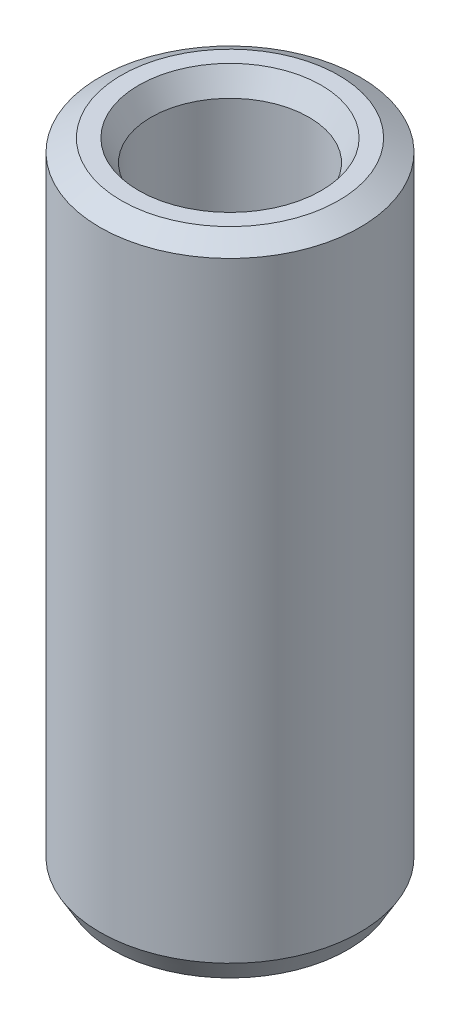
ISO-10303-21;
HEADER;
FILE_DESCRIPTION(('STEP AP214'),'2;1');
FILE_NAME('part.step','',(''),(''),'','','');
FILE_SCHEMA(('AUTOMOTIVE_DESIGN { 1 0 10303 214 1 1 1 1 }'));
ENDSEC;
DATA;
#1=APPLICATION_CONTEXT('core data for automotive mechanical design processes');
#2=APPLICATION_PROTOCOL_DEFINITION('international standard','automotive_design',2000,#1);
#3=PRODUCT_CONTEXT('',#1,'mechanical');
#4=PRODUCT('Part','Part','',(#3));
#5=PRODUCT_RELATED_PRODUCT_CATEGORY('part','',(#4));
#6=PRODUCT_DEFINITION_FORMATION('','',#4);
#7=PRODUCT_DEFINITION_CONTEXT('part definition',#1,'design');
#8=PRODUCT_DEFINITION('design','',#6,#7);
#9=PRODUCT_DEFINITION_SHAPE('','',#8);
#10=(LENGTH_UNIT() NAMED_UNIT(*) SI_UNIT(.MILLI.,.METRE.));
#11=(NAMED_UNIT(*) PLANE_ANGLE_UNIT() SI_UNIT($,.RADIAN.));
#12=(NAMED_UNIT(*) SI_UNIT($,.STERADIAN.) SOLID_ANGLE_UNIT());
#13=UNCERTAINTY_MEASURE_WITH_UNIT(LENGTH_MEASURE(1.E-05),#10,'distance_accuracy_value','');
#14=(GEOMETRIC_REPRESENTATION_CONTEXT(3) GLOBAL_UNCERTAINTY_ASSIGNED_CONTEXT((#13)) GLOBAL_UNIT_ASSIGNED_CONTEXT((#10,
#11,#12)) REPRESENTATION_CONTEXT('',''));
#15=CARTESIAN_POINT('',(0.,0.,0.));
#16=DIRECTION('',(0.,0.,1.));
#17=DIRECTION('',(1.,0.,0.));
#18=AXIS2_PLACEMENT_3D('',#15,#16,#17);
#19=CARTESIAN_POINT('',(0.,111.401906015621,0.));
#20=DIRECTION('',(0.,-1.,0.));
#21=DIRECTION('',(0.,0.,-1.));
#22=AXIS2_PLACEMENT_3D('',#19,#20,#21);
#23=CYLINDRICAL_SURFACE('',#22,22.5);
#24=CARTESIAN_POINT('',(0.,3.71535277580133,0.));
#25=DIRECTION('',(0.,1.,0.));
#26=DIRECTION('',(0.,0.,1.));
#27=AXIS2_PLACEMENT_3D('',#24,#25,#26);
#28=CIRCLE('',#27,22.5);
#29=CARTESIAN_POINT('',(0.,3.71535277580133,22.5));
#30=VERTEX_POINT('',#29);
#31=EDGE_CURVE('E10',#30,#30,#28,.T.);
#32=ORIENTED_EDGE('',*,*,#31,.T.);
#33=EDGE_LOOP('',(#32));
#34=FACE_BOUND('',#33,.T.);
#35=CARTESIAN_POINT('',(0.,109.256846090378,0.));
#36=DIRECTION('',(0.,1.,0.));
#37=DIRECTION('',(0.,0.,1.));
#38=AXIS2_PLACEMENT_3D('',#35,#36,#37);
#39=CIRCLE('',#38,22.5);
#40=CARTESIAN_POINT('',(0.,109.256846090378,22.5));
#41=VERTEX_POINT('',#40);
#42=EDGE_CURVE('E50',#41,#41,#39,.F.);
#43=ORIENTED_EDGE('',*,*,#42,.T.);
#44=EDGE_LOOP('',(#43));
#45=FACE_BOUND('',#44,.T.);
#46=ADVANCED_FACE('F39',(#34,#45),#23,.T.);
#47=CARTESIAN_POINT('',(0.,111.401906015621,0.));
#48=DIRECTION('',(0.,1.,0.));
#49=DIRECTION('',(0.,0.,1.));
#50=AXIS2_PLACEMENT_3D('',#47,#48,#49);
#51=PLANE('',#50);
#52=CARTESIAN_POINT('',(0.,111.401906015621,0.));
#53=DIRECTION('',(0.,1.,0.));
#54=DIRECTION('',(0.,0.,1.));
#55=AXIS2_PLACEMENT_3D('',#52,#53,#54);
#56=CIRCLE('',#55,15.7867235706911);
#57=CARTESIAN_POINT('',(0.,111.401906015621,15.7867235706911));
#58=VERTEX_POINT('',#57);
#59=EDGE_CURVE('E58',#58,#58,#56,.F.);
#60=ORIENTED_EDGE('',*,*,#59,.T.);
#61=EDGE_LOOP('',(#60));
#62=FACE_BOUND('',#61,.T.);
#63=CARTESIAN_POINT('',(0.,111.401906015621,0.));
#64=DIRECTION('',(0.,1.,0.));
#65=DIRECTION('',(0.,0.,1.));
#66=AXIS2_PLACEMENT_3D('',#63,#64,#65);
#67=CIRCLE('',#66,18.7846472241987);
#68=CARTESIAN_POINT('',(0.,111.401906015621,18.7846472241987));
#69=VERTEX_POINT('',#68);
#70=EDGE_CURVE('E61',#69,#69,#67,.T.);
#71=ORIENTED_EDGE('',*,*,#70,.T.);
#72=EDGE_LOOP('',(#71));
#73=FACE_BOUND('',#72,.T.);
#74=ADVANCED_FACE('F88',(#62,#73),#51,.T.);
#75=CARTESIAN_POINT('',(0.,0.,0.));
#76=DIRECTION('',(0.,1.,0.));
#77=DIRECTION('',(0.,0.,1.));
#78=AXIS2_PLACEMENT_3D('',#75,#76,#77);
#79=PLANE('',#78);
#80=CARTESIAN_POINT('',(0.,0.,0.));
#81=DIRECTION('',(0.,1.,0.));
#82=DIRECTION('',(0.,0.,1.));
#83=AXIS2_PLACEMENT_3D('',#80,#81,#82);
#84=CIRCLE('',#83,17.3570164212491);
#85=CARTESIAN_POINT('',(0.,0.,17.3570164212491));
#86=VERTEX_POINT('',#85);
#87=EDGE_CURVE('E51',#86,#86,#84,.T.);
#88=ORIENTED_EDGE('',*,*,#87,.T.);
#89=EDGE_LOOP('',(#88));
#90=FACE_BOUND('',#89,.T.);
#91=CARTESIAN_POINT('',(0.,0.,0.));
#92=DIRECTION('',(0.,1.,0.));
#93=DIRECTION('',(0.,0.,1.));
#94=AXIS2_PLACEMENT_3D('',#91,#92,#93);
#95=CIRCLE('',#94,20.3549400747567);
#96=CARTESIAN_POINT('',(0.,0.,20.3549400747567));
#97=VERTEX_POINT('',#96);
#98=EDGE_CURVE('E54',#97,#97,#95,.F.);
#99=ORIENTED_EDGE('',*,*,#98,.T.);
#100=EDGE_LOOP('',(#99));
#101=FACE_BOUND('',#100,.T.);
#102=ADVANCED_FACE('F83',(#90,#101),#79,.F.);
#103=CARTESIAN_POINT('',(0.,111.401906015621,0.));
#104=DIRECTION('',(0.,-1.,0.));
#105=DIRECTION('',(0.,0.,-1.));
#106=AXIS2_PLACEMENT_3D('',#103,#104,#105);
#107=CYLINDRICAL_SURFACE('',#106,13.6416636454477);
#108=CARTESIAN_POINT('',(0.,107.68655323982,0.));
#109=DIRECTION('',(0.,1.,0.));
#110=DIRECTION('',(0.,0.,1.));
#111=AXIS2_PLACEMENT_3D('',#108,#109,#110);
#112=CIRCLE('',#111,13.6416636454477);
#113=CARTESIAN_POINT('',(0.,107.68655323982,13.6416636454477));
#114=VERTEX_POINT('',#113);
#115=EDGE_CURVE('E67',#114,#114,#112,.T.);
#116=ORIENTED_EDGE('',*,*,#115,.T.);
#117=EDGE_LOOP('',(#116));
#118=FACE_BOUND('',#117,.T.);
#119=CARTESIAN_POINT('',(0.,2.14505992524334,0.));
#120=DIRECTION('',(0.,1.,0.));
#121=DIRECTION('',(0.,0.,1.));
#122=AXIS2_PLACEMENT_3D('',#119,#120,#121);
#123=CIRCLE('',#122,13.6416636454477);
#124=CARTESIAN_POINT('',(0.,2.14505992524334,13.6416636454477));
#125=VERTEX_POINT('',#124);
#126=EDGE_CURVE('E69',#125,#125,#123,.F.);
#127=ORIENTED_EDGE('',*,*,#126,.T.);
#128=EDGE_LOOP('',(#127));
#129=FACE_BOUND('',#128,.T.);
#130=ADVANCED_FACE('F71',(#118,#129),#107,.F.);
#131=CARTESIAN_POINT('',(0.,107.68655323982,0.));
#132=DIRECTION('',(0.,1.,0.));
#133=DIRECTION('',(0.,0.,1.));
#134=AXIS2_PLACEMENT_3D('',#131,#132,#133);
#135=CONICAL_SURFACE('',#134,13.6416636454477,0.523598775598305);
#136=ORIENTED_EDGE('',*,*,#59,.F.);
#137=EDGE_LOOP('',(#136));
#138=FACE_BOUND('',#137,.T.);
#139=ORIENTED_EDGE('',*,*,#115,.F.);
#140=EDGE_LOOP('',(#139));
#141=FACE_BOUND('',#140,.T.);
#142=ADVANCED_FACE('F77',(#138,#141),#135,.F.);
#143=CARTESIAN_POINT('',(0.,0.,0.));
#144=DIRECTION('',(0.,-1.,0.));
#145=DIRECTION('',(0.,0.,-1.));
#146=AXIS2_PLACEMENT_3D('',#143,#144,#145);
#147=CONICAL_SURFACE('',#146,17.3570164212491,1.04719755119659);
#148=ORIENTED_EDGE('',*,*,#126,.F.);
#149=EDGE_LOOP('',(#148));
#150=FACE_BOUND('',#149,.T.);
#151=ORIENTED_EDGE('',*,*,#87,.F.);
#152=EDGE_LOOP('',(#151));
#153=FACE_BOUND('',#152,.T.);
#154=ADVANCED_FACE('F73',(#150,#153),#147,.F.);
#155=CARTESIAN_POINT('',(0.,3.71535277580133,0.));
#156=DIRECTION('',(0.,1.,0.));
#157=DIRECTION('',(0.,0.,1.));
#158=AXIS2_PLACEMENT_3D('',#155,#156,#157);
#159=CONICAL_SURFACE('',#158,22.5,0.523598775598303);
#160=CARTESIAN_POINT('',(0.,0.,20.3549400747567));
#161=CARTESIAN_POINT('',(0.,0.0387015914145972,20.3772844489779));
#162=CARTESIAN_POINT('',(0.,0.0774031828291943,20.3996288231992));
#163=CARTESIAN_POINT('',(0.,0.154806365658389,20.4443175716418));
#164=CARTESIAN_POINT('',(0.,0.193507957072986,20.4666619458631));
#165=CARTESIAN_POINT('',(0.,0.27091113990218,20.5113506943057));
#166=CARTESIAN_POINT('',(0.,0.309612731316777,20.5336950685269));
#167=CARTESIAN_POINT('',(0.,0.387015914145971,20.5783838169695));
#168=CARTESIAN_POINT('',(0.,0.425717505560569,20.6007281911908));
#169=CARTESIAN_POINT('',(0.,0.503120688389763,20.6454169396334));
#170=CARTESIAN_POINT('',(0.,0.54182227980436,20.6677613138546));
#171=CARTESIAN_POINT('',(0.,0.619225462633554,20.7124500622972));
#172=CARTESIAN_POINT('',(0.,0.657927054048152,20.7347944365185));
#173=CARTESIAN_POINT('',(0.,0.735330236877347,20.7794831849611));
#174=CARTESIAN_POINT('',(0.,0.774031828291944,20.8018275591824));
#175=CARTESIAN_POINT('',(0.,0.851435011121138,20.8465163076249));
#176=CARTESIAN_POINT('',(0.,0.890136602535735,20.8688606818462));
#177=CARTESIAN_POINT('',(0.,0.96753978536493,20.9135494302888));
#178=CARTESIAN_POINT('',(0.,1.00624137677953,20.9358938045101));
#179=CARTESIAN_POINT('',(0.,1.08364455960872,20.9805825529526));
#180=CARTESIAN_POINT('',(0.,1.12234615102332,21.0029269271739));
#181=CARTESIAN_POINT('',(0.,1.19974933385251,21.0476156756165));
#182=CARTESIAN_POINT('',(0.,1.23845092526711,21.0699600498378));
#183=CARTESIAN_POINT('',(0.,1.3158541080963,21.1146487982803));
#184=CARTESIAN_POINT('',(0.,1.3545556995109,21.1369931725016));
#185=CARTESIAN_POINT('',(0.,1.4319588823401,21.1816819209442));
#186=CARTESIAN_POINT('',(0.,1.47066047375469,21.2040262951655));
#187=CARTESIAN_POINT('',(0.,1.54806365658389,21.2487150436081));
#188=CARTESIAN_POINT('',(0.,1.58676524799849,21.2710594178293));
#189=CARTESIAN_POINT('',(0.,1.66416843082768,21.3157481662719));
#190=CARTESIAN_POINT('',(0.,1.70287002224228,21.3380925404932));
#191=CARTESIAN_POINT('',(0.,1.78027320507147,21.3827812889358));
#192=CARTESIAN_POINT('',(0.,1.81897479648607,21.405125663157));
#193=CARTESIAN_POINT('',(0.,1.89637797931526,21.4498144115996));
#194=CARTESIAN_POINT('',(0.,1.93507957072986,21.4721587858209));
#195=CARTESIAN_POINT('',(0.,2.01248275355905,21.5168475342635));
#196=CARTESIAN_POINT('',(0.,2.05118434497365,21.5391919084848));
#197=CARTESIAN_POINT('',(0.,2.12858752780285,21.5838806569273));
#198=CARTESIAN_POINT('',(0.,2.16728911921744,21.6062250311486));
#199=CARTESIAN_POINT('',(0.,2.24469230204664,21.6509137795912));
#200=CARTESIAN_POINT('',(0.,2.28339389346123,21.6732581538125));
#201=CARTESIAN_POINT('',(0.,2.36079707629043,21.717946902255));
#202=CARTESIAN_POINT('',(0.,2.39949866770503,21.7402912764763));
#203=CARTESIAN_POINT('',(0.,2.47690185053422,21.7849800249189));
#204=CARTESIAN_POINT('',(0.,2.51560344194882,21.8073243991402));
#205=CARTESIAN_POINT('',(0.,2.59300662477801,21.8520131475827));
#206=CARTESIAN_POINT('',(0.,2.63170821619261,21.874357521804));
#207=CARTESIAN_POINT('',(0.,2.7091113990218,21.9190462702466));
#208=CARTESIAN_POINT('',(0.,2.7478129904364,21.9413906444679));
#209=CARTESIAN_POINT('',(0.,2.8252161732656,21.9860793929105));
#210=CARTESIAN_POINT('',(0.,2.86391776468019,22.0084237671317));
#211=CARTESIAN_POINT('',(0.,2.94132094750939,22.0531125155743));
#212=CARTESIAN_POINT('',(0.,2.98002253892398,22.0754568897956));
#213=CARTESIAN_POINT('',(0.,3.05742572175318,22.1201456382382));
#214=CARTESIAN_POINT('',(0.,3.09612731316778,22.1424900124594));
#215=CARTESIAN_POINT('',(0.,3.17353049599697,22.187178760902));
#216=CARTESIAN_POINT('',(0.,3.21223208741157,22.2095231351233));
#217=CARTESIAN_POINT('',(0.,3.28963527024076,22.2542118835659));
#218=CARTESIAN_POINT('',(0.,3.32833686165536,22.2765562577872));
#219=CARTESIAN_POINT('',(0.,3.40574004448455,22.3212450062297));
#220=CARTESIAN_POINT('',(0.,3.44444163589915,22.343589380451));
#221=CARTESIAN_POINT('',(0.,3.52184481872834,22.3882781288936));
#222=CARTESIAN_POINT('',(0.,3.56054641014294,22.4106225031149));
#223=CARTESIAN_POINT('',(0.,3.63794959297214,22.4553112515574));
#224=CARTESIAN_POINT('',(0.,3.67665118438673,22.4776556257787));
#225=CARTESIAN_POINT('',(0.,3.71535277580133,22.5));
#226=B_SPLINE_CURVE_WITH_KNOTS('',3,(#160,#161,#162,#163,#164,#165,#166,#167,#168,#169,#170,
#171,#172,#173,#174,#175,#176,#177,#178,#179,#180,#181,#182,#183,#184,#185,#186,#187,#188,#189,
#190,#191,#192,#193,#194,#195,#196,#197,#198,#199,#200,#201,#202,#203,#204,#205,#206,#207,#208,
#209,#210,#211,#212,#213,#214,#215,#216,#217,#218,#219,#220,#221,#222,#223,#224,#225),
.UNSPECIFIED.,.F.,.F.,(4,2,2,2,2,2,2,2,2,2,2,2,2,2,2,2,2,2,2,2,2,2,2,2,2,2,2,2,2,2,2,2,4),(0.,
0.134066245327707,0.268132490655416,0.402198735983124,0.536264981310831,0.67033122663854,
0.804397471966247,0.938463717293955,1.07252996262166,1.20659620794937,1.34066245327708,
1.47472869860479,1.60879494393249,1.7428611892602,1.87692743458791,2.01099367991562,
2.14505992524333,2.27912617057103,2.41319241589874,2.54725866122645,2.68132490655416,
2.81539115188187,2.94945739720957,3.08352364253728,3.21758988786499,3.3516561331927,
3.48572237852041,3.61978862384811,3.75385486917582,3.88792111450353,4.02198735983124,
4.15605360515895,4.29011985048665),.UNSPECIFIED.);
#227=EDGE_CURVE('BSEAM76',#97,#30,#226,.T.);
#228=ORIENTED_EDGE('',*,*,#98,.F.);
#229=ORIENTED_EDGE('',*,*,#31,.F.);
#230=ORIENTED_EDGE('',*,*,#227,.T.);
#231=ORIENTED_EDGE('',*,*,#227,.F.);
#232=EDGE_LOOP('',(#228,#230,#229,#231));
#233=FACE_BOUND('',#232,.T.);
#234=ADVANCED_FACE('F76',(#233),#159,.T.);
#235=CARTESIAN_POINT('',(0.,111.401906015621,0.));
#236=DIRECTION('',(0.,-1.,0.));
#237=DIRECTION('',(0.,0.,-1.));
#238=AXIS2_PLACEMENT_3D('',#235,#236,#237);
#239=CONICAL_SURFACE('',#238,18.7846472241987,1.04719755119659);
#240=ORIENTED_EDGE('',*,*,#42,.F.);
#241=EDGE_LOOP('',(#240));
#242=FACE_BOUND('',#241,.T.);
#243=ORIENTED_EDGE('',*,*,#70,.F.);
#244=EDGE_LOOP('',(#243));
#245=FACE_BOUND('',#244,.T.);
#246=ADVANCED_FACE('F45',(#242,#245),#239,.T.);
#247=CLOSED_SHELL('',(#46,#74,#102,#130,#142,#154,#234,#246));
#248=MANIFOLD_SOLID_BREP('B2',#247);
#249=ADVANCED_BREP_SHAPE_REPRESENTATION('',(#18,#248),#14);
#250=SHAPE_DEFINITION_REPRESENTATION(#9,#249);
ENDSEC;
END-ISO-10303-21;
